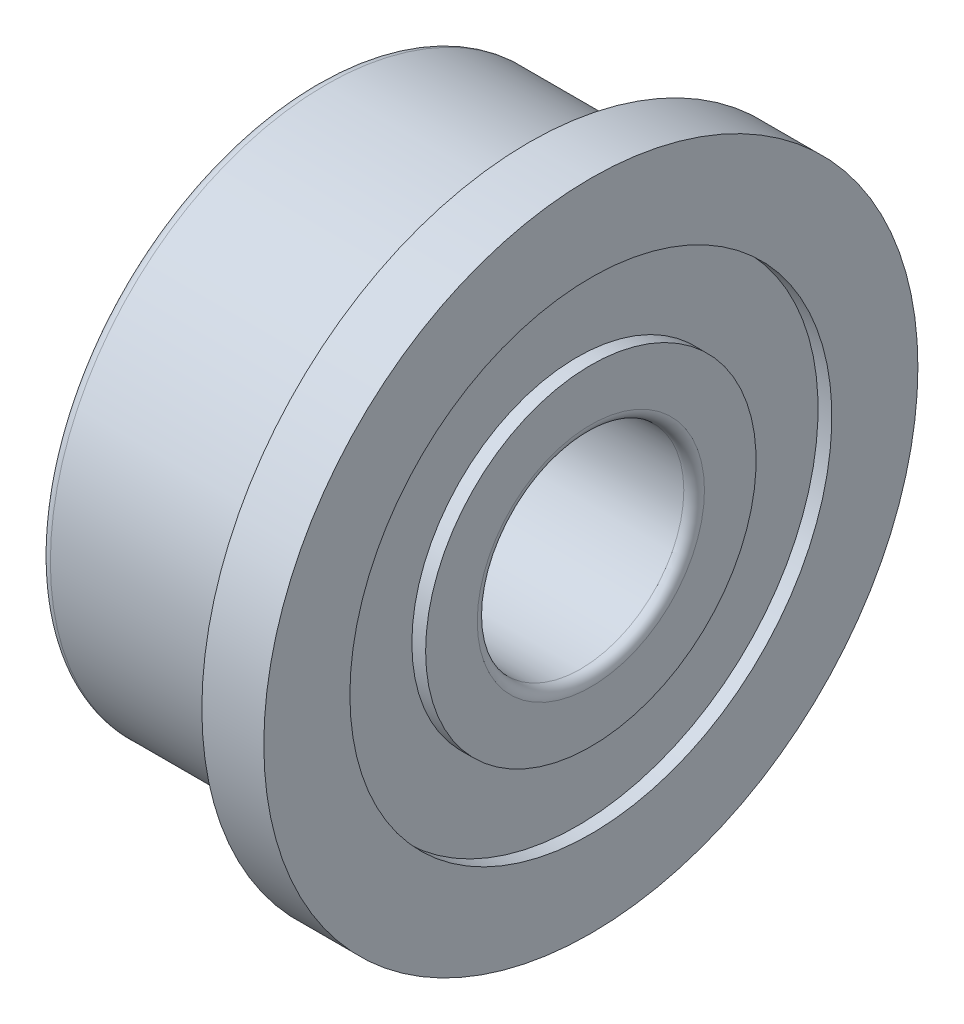
ISO-10303-21;
HEADER;
FILE_DESCRIPTION(('STEP AP214'),'2;1');
FILE_NAME('part.step','',(''),(''),'','','');
FILE_SCHEMA(('AUTOMOTIVE_DESIGN { 1 0 10303 214 1 1 1 1 }'));
ENDSEC;
DATA;
#1=APPLICATION_CONTEXT('core data for automotive mechanical design processes');
#2=APPLICATION_PROTOCOL_DEFINITION('international standard','automotive_design',2000,#1);
#3=PRODUCT_CONTEXT('',#1,'mechanical');
#4=PRODUCT('Part','Part','',(#3));
#5=PRODUCT_RELATED_PRODUCT_CATEGORY('part','',(#4));
#6=PRODUCT_DEFINITION_FORMATION('','',#4);
#7=PRODUCT_DEFINITION_CONTEXT('part definition',#1,'design');
#8=PRODUCT_DEFINITION('design','',#6,#7);
#9=PRODUCT_DEFINITION_SHAPE('','',#8);
#10=(LENGTH_UNIT() NAMED_UNIT(*) SI_UNIT(.MILLI.,.METRE.));
#11=(NAMED_UNIT(*) PLANE_ANGLE_UNIT() SI_UNIT($,.RADIAN.));
#12=(NAMED_UNIT(*) SI_UNIT($,.STERADIAN.) SOLID_ANGLE_UNIT());
#13=UNCERTAINTY_MEASURE_WITH_UNIT(LENGTH_MEASURE(1.E-05),#10,'distance_accuracy_value','');
#14=(GEOMETRIC_REPRESENTATION_CONTEXT(3) GLOBAL_UNCERTAINTY_ASSIGNED_CONTEXT((#13)) GLOBAL_UNIT_ASSIGNED_CONTEXT((#10,
#11,#12)) REPRESENTATION_CONTEXT('',''));
#15=CARTESIAN_POINT('',(0.,0.,0.));
#16=DIRECTION('',(0.,0.,1.));
#17=DIRECTION('',(1.,0.,0.));
#18=AXIS2_PLACEMENT_3D('',#15,#16,#17);
#19=CARTESIAN_POINT('',(-3.1,0.,0.));
#20=DIRECTION('',(-1.,0.,0.));
#21=DIRECTION('',(0.,0.,1.));
#22=AXIS2_PLACEMENT_3D('',#19,#20,#21);
#23=CYLINDRICAL_SURFACE('',#22,4.75);
#24=CARTESIAN_POINT('',(0.,0.,0.));
#25=DIRECTION('',(-1.,0.,0.));
#26=DIRECTION('',(0.,0.,1.));
#27=AXIS2_PLACEMENT_3D('',#24,#25,#26);
#28=CIRCLE('',#27,4.75);
#29=CARTESIAN_POINT('',(0.,0.,4.75));
#30=VERTEX_POINT('',#29);
#31=EDGE_CURVE('E57',#30,#30,#28,.T.);
#32=ORIENTED_EDGE('',*,*,#31,.F.);
#33=EDGE_LOOP('',(#32));
#34=FACE_BOUND('',#33,.T.);
#35=CARTESIAN_POINT('',(0.9,0.,0.));
#36=DIRECTION('',(-1.,0.,0.));
#37=DIRECTION('',(0.,0.,1.));
#38=AXIS2_PLACEMENT_3D('',#35,#36,#37);
#39=CIRCLE('',#38,4.75);
#40=CARTESIAN_POINT('',(0.9,0.,4.75));
#41=VERTEX_POINT('',#40);
#42=EDGE_CURVE('E90',#41,#41,#39,.T.);
#43=ORIENTED_EDGE('',*,*,#42,.T.);
#44=EDGE_LOOP('',(#43));
#45=FACE_BOUND('',#44,.T.);
#46=ADVANCED_FACE('F31',(#34,#45),#23,.T.);
#47=CARTESIAN_POINT('',(0.,4.2,0.));
#48=DIRECTION('',(1.,0.,0.));
#49=DIRECTION('',(0.,0.,-1.));
#50=AXIS2_PLACEMENT_3D('',#47,#48,#49);
#51=PLANE('',#50);
#52=CARTESIAN_POINT('',(0.,0.,0.));
#53=DIRECTION('',(-1.,0.,0.));
#54=DIRECTION('',(0.,0.,1.));
#55=AXIS2_PLACEMENT_3D('',#52,#53,#54);
#56=CIRCLE('',#55,4.2);
#57=CARTESIAN_POINT('',(0.,0.,4.2));
#58=VERTEX_POINT('',#57);
#59=EDGE_CURVE('E60',#58,#58,#56,.T.);
#60=ORIENTED_EDGE('',*,*,#59,.F.);
#61=EDGE_LOOP('',(#60));
#62=FACE_BOUND('',#61,.T.);
#63=ORIENTED_EDGE('',*,*,#31,.T.);
#64=EDGE_LOOP('',(#63));
#65=FACE_BOUND('',#64,.T.);
#66=ADVANCED_FACE('F132',(#62,#65),#51,.F.);
#67=CARTESIAN_POINT('',(0.,0.,0.));
#68=DIRECTION('',(-1.,0.,0.));
#69=DIRECTION('',(0.,0.,1.));
#70=AXIS2_PLACEMENT_3D('',#67,#68,#69);
#71=TOROIDAL_SURFACE('',#70,4.,0.2);
#72=CARTESIAN_POINT('',(-0.2,0.,0.));
#73=DIRECTION('',(-1.,0.,0.));
#74=DIRECTION('',(0.,0.,1.));
#75=AXIS2_PLACEMENT_3D('',#72,#73,#74);
#76=CIRCLE('',#75,4.);
#77=CARTESIAN_POINT('',(-0.2,0.,4.));
#78=VERTEX_POINT('',#77);
#79=EDGE_CURVE('E63',#78,#78,#76,.T.);
#80=ORIENTED_EDGE('',*,*,#79,.F.);
#81=EDGE_LOOP('',(#80));
#82=FACE_BOUND('',#81,.T.);
#83=ORIENTED_EDGE('',*,*,#59,.T.);
#84=EDGE_LOOP('',(#83));
#85=FACE_BOUND('',#84,.T.);
#86=ADVANCED_FACE('F138',(#82,#85),#71,.F.);
#87=CARTESIAN_POINT('',(-3.1,0.,0.));
#88=DIRECTION('',(-1.,0.,0.));
#89=DIRECTION('',(0.,0.,1.));
#90=AXIS2_PLACEMENT_3D('',#87,#88,#89);
#91=CYLINDRICAL_SURFACE('',#90,4.);
#92=CARTESIAN_POINT('',(-2.95,0.,0.));
#93=DIRECTION('',(1.,0.,0.));
#94=DIRECTION('',(0.,0.,-1.));
#95=AXIS2_PLACEMENT_3D('',#92,#93,#94);
#96=CIRCLE('',#95,4.);
#97=CARTESIAN_POINT('',(-2.95,0.,-4.));
#98=VERTEX_POINT('',#97);
#99=EDGE_CURVE('E10',#98,#98,#96,.T.);
#100=ORIENTED_EDGE('',*,*,#99,.T.);
#101=EDGE_LOOP('',(#100));
#102=FACE_BOUND('',#101,.T.);
#103=ORIENTED_EDGE('',*,*,#79,.T.);
#104=EDGE_LOOP('',(#103));
#105=FACE_BOUND('',#104,.T.);
#106=ADVANCED_FACE('F183',(#102,#105),#91,.T.);
#107=CARTESIAN_POINT('',(-3.1,3.5,0.));
#108=DIRECTION('',(1.,0.,0.));
#109=DIRECTION('',(0.,0.,-1.));
#110=AXIS2_PLACEMENT_3D('',#107,#108,#109);
#111=PLANE('',#110);
#112=CARTESIAN_POINT('',(-3.1,0.,0.));
#113=DIRECTION('',(1.,0.,0.));
#114=DIRECTION('',(0.,0.,-1.));
#115=AXIS2_PLACEMENT_3D('',#112,#113,#114);
#116=CIRCLE('',#115,3.85);
#117=CARTESIAN_POINT('',(-3.1,0.,-3.85));
#118=VERTEX_POINT('',#117);
#119=EDGE_CURVE('E38',#118,#118,#116,.F.);
#120=ORIENTED_EDGE('',*,*,#119,.T.);
#121=EDGE_LOOP('',(#120));
#122=FACE_BOUND('',#121,.T.);
#123=CARTESIAN_POINT('',(-3.1,0.,0.));
#124=DIRECTION('',(-1.,0.,0.));
#125=DIRECTION('',(0.,0.,1.));
#126=AXIS2_PLACEMENT_3D('',#123,#124,#125);
#127=CIRCLE('',#126,3.5);
#128=CARTESIAN_POINT('',(-3.1,0.,3.5));
#129=VERTEX_POINT('',#128);
#130=EDGE_CURVE('E66',#129,#129,#127,.T.);
#131=ORIENTED_EDGE('',*,*,#130,.F.);
#132=EDGE_LOOP('',(#131));
#133=FACE_BOUND('',#132,.T.);
#134=ADVANCED_FACE('F178',(#122,#133),#111,.F.);
#135=CARTESIAN_POINT('',(-3.1,0.,0.));
#136=DIRECTION('',(-1.,0.,0.));
#137=DIRECTION('',(0.,0.,1.));
#138=AXIS2_PLACEMENT_3D('',#135,#136,#137);
#139=CYLINDRICAL_SURFACE('',#138,3.5);
#140=CARTESIAN_POINT('',(-2.9,0.,0.));
#141=DIRECTION('',(-1.,0.,0.));
#142=DIRECTION('',(0.,0.,1.));
#143=AXIS2_PLACEMENT_3D('',#140,#141,#142);
#144=CIRCLE('',#143,3.5);
#145=CARTESIAN_POINT('',(-2.9,0.,3.5));
#146=VERTEX_POINT('',#145);
#147=EDGE_CURVE('E69',#146,#146,#144,.T.);
#148=ORIENTED_EDGE('',*,*,#147,.F.);
#149=EDGE_LOOP('',(#148));
#150=FACE_BOUND('',#149,.T.);
#151=ORIENTED_EDGE('',*,*,#130,.T.);
#152=EDGE_LOOP('',(#151));
#153=FACE_BOUND('',#152,.T.);
#154=ADVANCED_FACE('F172',(#150,#153),#139,.F.);
#155=CARTESIAN_POINT('',(-2.9,3.5,0.));
#156=DIRECTION('',(1.,0.,0.));
#157=DIRECTION('',(0.,0.,-1.));
#158=AXIS2_PLACEMENT_3D('',#155,#156,#157);
#159=PLANE('',#158);
#160=CARTESIAN_POINT('',(-2.9,0.,0.));
#161=DIRECTION('',(-1.,0.,0.));
#162=DIRECTION('',(0.,0.,1.));
#163=AXIS2_PLACEMENT_3D('',#160,#161,#162);
#164=CIRCLE('',#163,2.4);
#165=CARTESIAN_POINT('',(-2.9,0.,2.4));
#166=VERTEX_POINT('',#165);
#167=EDGE_CURVE('E72',#166,#166,#164,.T.);
#168=ORIENTED_EDGE('',*,*,#167,.F.);
#169=EDGE_LOOP('',(#168));
#170=FACE_BOUND('',#169,.T.);
#171=ORIENTED_EDGE('',*,*,#147,.T.);
#172=EDGE_LOOP('',(#171));
#173=FACE_BOUND('',#172,.T.);
#174=ADVANCED_FACE('F166',(#170,#173),#159,.F.);
#175=CARTESIAN_POINT('',(-3.1,0.,0.));
#176=DIRECTION('',(-1.,0.,0.));
#177=DIRECTION('',(0.,0.,1.));
#178=AXIS2_PLACEMENT_3D('',#175,#176,#177);
#179=CYLINDRICAL_SURFACE('',#178,2.4);
#180=CARTESIAN_POINT('',(-3.1,0.,0.));
#181=DIRECTION('',(-1.,0.,0.));
#182=DIRECTION('',(0.,0.,1.));
#183=AXIS2_PLACEMENT_3D('',#180,#181,#182);
#184=CIRCLE('',#183,2.4);
#185=CARTESIAN_POINT('',(-3.1,0.,2.4));
#186=VERTEX_POINT('',#185);
#187=EDGE_CURVE('E75',#186,#186,#184,.T.);
#188=ORIENTED_EDGE('',*,*,#187,.F.);
#189=EDGE_LOOP('',(#188));
#190=FACE_BOUND('',#189,.T.);
#191=ORIENTED_EDGE('',*,*,#167,.T.);
#192=EDGE_LOOP('',(#191));
#193=FACE_BOUND('',#192,.T.);
#194=ADVANCED_FACE('F160',(#190,#193),#179,.T.);
#195=CARTESIAN_POINT('',(-3.1,1.5,0.));
#196=DIRECTION('',(1.,0.,0.));
#197=DIRECTION('',(0.,0.,-1.));
#198=AXIS2_PLACEMENT_3D('',#195,#196,#197);
#199=PLANE('',#198);
#200=CARTESIAN_POINT('',(-3.1,0.,0.));
#201=DIRECTION('',(1.,0.,0.));
#202=DIRECTION('',(0.,0.,-1.));
#203=AXIS2_PLACEMENT_3D('',#200,#201,#202);
#204=CIRCLE('',#203,1.65);
#205=CARTESIAN_POINT('',(-3.1,0.,-1.65));
#206=VERTEX_POINT('',#205);
#207=EDGE_CURVE('E42',#206,#206,#204,.T.);
#208=ORIENTED_EDGE('',*,*,#207,.T.);
#209=EDGE_LOOP('',(#208));
#210=FACE_BOUND('',#209,.T.);
#211=ORIENTED_EDGE('',*,*,#187,.T.);
#212=EDGE_LOOP('',(#211));
#213=FACE_BOUND('',#212,.T.);
#214=ADVANCED_FACE('F128',(#210,#213),#199,.F.);
#215=CARTESIAN_POINT('',(-3.1,0.,0.));
#216=DIRECTION('',(-1.,0.,0.));
#217=DIRECTION('',(0.,0.,1.));
#218=AXIS2_PLACEMENT_3D('',#215,#216,#217);
#219=CYLINDRICAL_SURFACE('',#218,1.5);
#220=CARTESIAN_POINT('',(0.75,0.,0.));
#221=DIRECTION('',(-1.,0.,0.));
#222=DIRECTION('',(0.,0.,1.));
#223=AXIS2_PLACEMENT_3D('',#220,#221,#222);
#224=CIRCLE('',#223,1.5);
#225=CARTESIAN_POINT('',(0.75,0.,1.5));
#226=VERTEX_POINT('',#225);
#227=EDGE_CURVE('E46',#226,#226,#224,.F.);
#228=ORIENTED_EDGE('',*,*,#227,.T.);
#229=EDGE_LOOP('',(#228));
#230=FACE_BOUND('',#229,.T.);
#231=CARTESIAN_POINT('',(-2.95,0.,0.));
#232=DIRECTION('',(1.,0.,0.));
#233=DIRECTION('',(0.,0.,-1.));
#234=AXIS2_PLACEMENT_3D('',#231,#232,#233);
#235=CIRCLE('',#234,1.5);
#236=CARTESIAN_POINT('',(-2.95,0.,-1.5));
#237=VERTEX_POINT('',#236);
#238=EDGE_CURVE('E51',#237,#237,#235,.F.);
#239=ORIENTED_EDGE('',*,*,#238,.T.);
#240=EDGE_LOOP('',(#239));
#241=FACE_BOUND('',#240,.T.);
#242=ADVANCED_FACE('F122',(#230,#241),#219,.F.);
#243=CARTESIAN_POINT('',(0.9,2.4,0.));
#244=DIRECTION('',(-1.,0.,0.));
#245=DIRECTION('',(0.,0.,1.));
#246=AXIS2_PLACEMENT_3D('',#243,#244,#245);
#247=PLANE('',#246);
#248=CARTESIAN_POINT('',(0.9,0.,0.));
#249=DIRECTION('',(-1.,0.,0.));
#250=DIRECTION('',(0.,0.,1.));
#251=AXIS2_PLACEMENT_3D('',#248,#249,#250);
#252=CIRCLE('',#251,1.65);
#253=CARTESIAN_POINT('',(0.9,0.,1.65));
#254=VERTEX_POINT('',#253);
#255=EDGE_CURVE('E54',#254,#254,#252,.T.);
#256=ORIENTED_EDGE('',*,*,#255,.T.);
#257=EDGE_LOOP('',(#256));
#258=FACE_BOUND('',#257,.T.);
#259=CARTESIAN_POINT('',(0.9,0.,0.));
#260=DIRECTION('',(-1.,0.,0.));
#261=DIRECTION('',(0.,0.,1.));
#262=AXIS2_PLACEMENT_3D('',#259,#260,#261);
#263=CIRCLE('',#262,2.4);
#264=CARTESIAN_POINT('',(0.9,0.,2.4));
#265=VERTEX_POINT('',#264);
#266=EDGE_CURVE('E78',#265,#265,#263,.T.);
#267=ORIENTED_EDGE('',*,*,#266,.F.);
#268=EDGE_LOOP('',(#267));
#269=FACE_BOUND('',#268,.T.);
#270=ADVANCED_FACE('F117',(#258,#269),#247,.F.);
#271=CARTESIAN_POINT('',(-3.1,0.,0.));
#272=DIRECTION('',(-1.,0.,0.));
#273=DIRECTION('',(0.,0.,1.));
#274=AXIS2_PLACEMENT_3D('',#271,#272,#273);
#275=CYLINDRICAL_SURFACE('',#274,2.4);
#276=CARTESIAN_POINT('',(0.699999999999999,0.,0.));
#277=DIRECTION('',(-1.,0.,0.));
#278=DIRECTION('',(0.,0.,1.));
#279=AXIS2_PLACEMENT_3D('',#276,#277,#278);
#280=CIRCLE('',#279,2.4);
#281=CARTESIAN_POINT('',(0.699999999999999,0.,2.4));
#282=VERTEX_POINT('',#281);
#283=EDGE_CURVE('E81',#282,#282,#280,.T.);
#284=ORIENTED_EDGE('',*,*,#283,.F.);
#285=EDGE_LOOP('',(#284));
#286=FACE_BOUND('',#285,.T.);
#287=ORIENTED_EDGE('',*,*,#266,.T.);
#288=EDGE_LOOP('',(#287));
#289=FACE_BOUND('',#288,.T.);
#290=ADVANCED_FACE('F111',(#286,#289),#275,.T.);
#291=CARTESIAN_POINT('',(0.699999999999999,3.5,0.));
#292=DIRECTION('',(-1.,0.,0.));
#293=DIRECTION('',(0.,0.,1.));
#294=AXIS2_PLACEMENT_3D('',#291,#292,#293);
#295=PLANE('',#294);
#296=CARTESIAN_POINT('',(0.699999999999999,0.,0.));
#297=DIRECTION('',(-1.,0.,0.));
#298=DIRECTION('',(0.,0.,1.));
#299=AXIS2_PLACEMENT_3D('',#296,#297,#298);
#300=CIRCLE('',#299,3.5);
#301=CARTESIAN_POINT('',(0.699999999999999,0.,3.5));
#302=VERTEX_POINT('',#301);
#303=EDGE_CURVE('E84',#302,#302,#300,.T.);
#304=ORIENTED_EDGE('',*,*,#303,.F.);
#305=EDGE_LOOP('',(#304));
#306=FACE_BOUND('',#305,.T.);
#307=ORIENTED_EDGE('',*,*,#283,.T.);
#308=EDGE_LOOP('',(#307));
#309=FACE_BOUND('',#308,.T.);
#310=ADVANCED_FACE('F105',(#306,#309),#295,.F.);
#311=CARTESIAN_POINT('',(-3.1,0.,0.));
#312=DIRECTION('',(-1.,0.,0.));
#313=DIRECTION('',(0.,0.,1.));
#314=AXIS2_PLACEMENT_3D('',#311,#312,#313);
#315=CYLINDRICAL_SURFACE('',#314,3.5);
#316=CARTESIAN_POINT('',(0.9,0.,0.));
#317=DIRECTION('',(-1.,0.,0.));
#318=DIRECTION('',(0.,0.,1.));
#319=AXIS2_PLACEMENT_3D('',#316,#317,#318);
#320=CIRCLE('',#319,3.5);
#321=CARTESIAN_POINT('',(0.9,0.,3.5));
#322=VERTEX_POINT('',#321);
#323=EDGE_CURVE('E87',#322,#322,#320,.T.);
#324=ORIENTED_EDGE('',*,*,#323,.F.);
#325=EDGE_LOOP('',(#324));
#326=FACE_BOUND('',#325,.T.);
#327=ORIENTED_EDGE('',*,*,#303,.T.);
#328=EDGE_LOOP('',(#327));
#329=FACE_BOUND('',#328,.T.);
#330=ADVANCED_FACE('F99',(#326,#329),#315,.F.);
#331=CARTESIAN_POINT('',(0.9,4.75,0.));
#332=DIRECTION('',(-1.,0.,0.));
#333=DIRECTION('',(0.,0.,1.));
#334=AXIS2_PLACEMENT_3D('',#331,#332,#333);
#335=PLANE('',#334);
#336=ORIENTED_EDGE('',*,*,#42,.F.);
#337=EDGE_LOOP('',(#336));
#338=FACE_BOUND('',#337,.T.);
#339=ORIENTED_EDGE('',*,*,#323,.T.);
#340=EDGE_LOOP('',(#339));
#341=FACE_BOUND('',#340,.T.);
#342=ADVANCED_FACE('F95',(#338,#341),#335,.F.);
#343=CARTESIAN_POINT('',(0.75,0.,0.));
#344=DIRECTION('',(-1.,0.,0.));
#345=DIRECTION('',(0.,0.,1.));
#346=AXIS2_PLACEMENT_3D('',#343,#344,#345);
#347=TOROIDAL_SURFACE('',#346,1.65,0.15);
#348=ORIENTED_EDGE('',*,*,#227,.F.);
#349=EDGE_LOOP('',(#348));
#350=FACE_BOUND('',#349,.T.);
#351=ORIENTED_EDGE('',*,*,#255,.F.);
#352=EDGE_LOOP('',(#351));
#353=FACE_BOUND('',#352,.T.);
#354=ADVANCED_FACE('F98',(#350,#353),#347,.T.);
#355=CARTESIAN_POINT('',(-2.95,0.,0.));
#356=DIRECTION('',(1.,0.,0.));
#357=DIRECTION('',(0.,0.,-1.));
#358=AXIS2_PLACEMENT_3D('',#355,#356,#357);
#359=TOROIDAL_SURFACE('',#358,1.65,0.15);
#360=ORIENTED_EDGE('',*,*,#207,.F.);
#361=EDGE_LOOP('',(#360));
#362=FACE_BOUND('',#361,.T.);
#363=ORIENTED_EDGE('',*,*,#238,.F.);
#364=EDGE_LOOP('',(#363));
#365=FACE_BOUND('',#364,.T.);
#366=ADVANCED_FACE('F145',(#362,#365),#359,.T.);
#367=CARTESIAN_POINT('',(-2.95,0.,0.));
#368=DIRECTION('',(1.,0.,0.));
#369=DIRECTION('',(0.,0.,-1.));
#370=AXIS2_PLACEMENT_3D('',#367,#368,#369);
#371=TOROIDAL_SURFACE('',#370,3.85,0.15);
#372=ORIENTED_EDGE('',*,*,#99,.F.);
#373=EDGE_LOOP('',(#372));
#374=FACE_BOUND('',#373,.T.);
#375=ORIENTED_EDGE('',*,*,#119,.F.);
#376=EDGE_LOOP('',(#375));
#377=FACE_BOUND('',#376,.T.);
#378=ADVANCED_FACE('F33',(#374,#377),#371,.T.);
#379=CLOSED_SHELL('',(#46,#66,#86,#106,#134,#154,#174,#194,#214,#242,#270,#290,#310,#330,#342,
#354,#366,#378));
#380=MANIFOLD_SOLID_BREP('B2',#379);
#381=ADVANCED_BREP_SHAPE_REPRESENTATION('',(#18,#380),#14);
#382=SHAPE_DEFINITION_REPRESENTATION(#9,#381);
ENDSEC;
END-ISO-10303-21;
